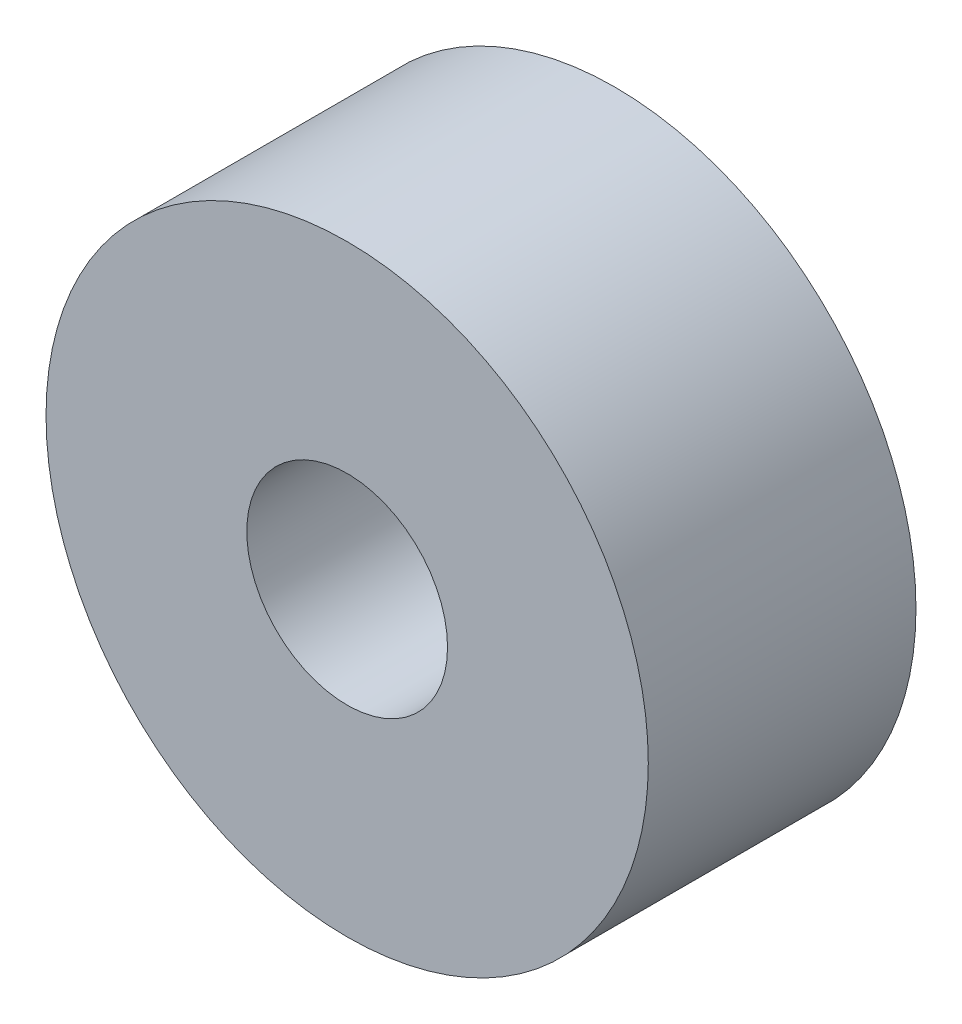
ISO-10303-21;
HEADER;
FILE_DESCRIPTION(('STEP AP214'),'2;1');
FILE_NAME('part.step','',(''),(''),'','','');
FILE_SCHEMA(('AUTOMOTIVE_DESIGN { 1 0 10303 214 1 1 1 1 }'));
ENDSEC;
DATA;
#1=APPLICATION_CONTEXT('core data for automotive mechanical design processes');
#2=APPLICATION_PROTOCOL_DEFINITION('international standard','automotive_design',2000,#1);
#3=PRODUCT_CONTEXT('',#1,'mechanical');
#4=PRODUCT('Part','Part','',(#3));
#5=PRODUCT_RELATED_PRODUCT_CATEGORY('part','',(#4));
#6=PRODUCT_DEFINITION_FORMATION('','',#4);
#7=PRODUCT_DEFINITION_CONTEXT('part definition',#1,'design');
#8=PRODUCT_DEFINITION('design','',#6,#7);
#9=PRODUCT_DEFINITION_SHAPE('','',#8);
#10=(LENGTH_UNIT() NAMED_UNIT(*) SI_UNIT(.MILLI.,.METRE.));
#11=(NAMED_UNIT(*) PLANE_ANGLE_UNIT() SI_UNIT($,.RADIAN.));
#12=(NAMED_UNIT(*) SI_UNIT($,.STERADIAN.) SOLID_ANGLE_UNIT());
#13=UNCERTAINTY_MEASURE_WITH_UNIT(LENGTH_MEASURE(1.E-05),#10,'distance_accuracy_value','');
#14=(GEOMETRIC_REPRESENTATION_CONTEXT(3) GLOBAL_UNCERTAINTY_ASSIGNED_CONTEXT((#13)) GLOBAL_UNIT_ASSIGNED_CONTEXT((#10,
#11,#12)) REPRESENTATION_CONTEXT('',''));
#15=CARTESIAN_POINT('',(0.,0.,0.));
#16=DIRECTION('',(0.,0.,1.));
#17=DIRECTION('',(1.,0.,0.));
#18=AXIS2_PLACEMENT_3D('',#15,#16,#17);
#19=CARTESIAN_POINT('',(0.,0.,4.));
#20=DIRECTION('',(0.,0.,1.));
#21=DIRECTION('',(1.,0.,0.));
#22=AXIS2_PLACEMENT_3D('',#19,#20,#21);
#23=PLANE('',#22);
#24=CARTESIAN_POINT('',(0.,0.,4.));
#25=DIRECTION('',(0.,0.,1.));
#26=DIRECTION('',(1.,0.,0.));
#27=AXIS2_PLACEMENT_3D('',#24,#25,#26);
#28=CIRCLE('',#27,4.5);
#29=CARTESIAN_POINT('',(4.5,0.,4.));
#30=VERTEX_POINT('',#29);
#31=EDGE_CURVE('E10',#30,#30,#28,.T.);
#32=ORIENTED_EDGE('',*,*,#31,.T.);
#33=EDGE_LOOP('',(#32));
#34=FACE_BOUND('',#33,.T.);
#35=CARTESIAN_POINT('',(0.,0.,4.));
#36=DIRECTION('',(0.,0.,1.));
#37=DIRECTION('',(1.,0.,0.));
#38=AXIS2_PLACEMENT_3D('',#35,#36,#37);
#39=CIRCLE('',#38,1.5);
#40=CARTESIAN_POINT('',(1.5,0.,4.));
#41=VERTEX_POINT('',#40);
#42=EDGE_CURVE('E50',#41,#41,#39,.T.);
#43=ORIENTED_EDGE('',*,*,#42,.F.);
#44=EDGE_LOOP('',(#43));
#45=FACE_BOUND('',#44,.T.);
#46=ADVANCED_FACE('F37',(#34,#45),#23,.T.);
#47=CARTESIAN_POINT('',(0.,0.,0.));
#48=DIRECTION('',(0.,0.,1.));
#49=DIRECTION('',(1.,0.,0.));
#50=AXIS2_PLACEMENT_3D('',#47,#48,#49);
#51=PLANE('',#50);
#52=CARTESIAN_POINT('',(0.,0.,0.));
#53=DIRECTION('',(0.,0.,1.));
#54=DIRECTION('',(1.,0.,0.));
#55=AXIS2_PLACEMENT_3D('',#52,#53,#54);
#56=CIRCLE('',#55,4.5);
#57=CARTESIAN_POINT('',(4.5,0.,0.));
#58=VERTEX_POINT('',#57);
#59=EDGE_CURVE('E41',#58,#58,#56,.T.);
#60=ORIENTED_EDGE('',*,*,#59,.F.);
#61=EDGE_LOOP('',(#60));
#62=FACE_BOUND('',#61,.T.);
#63=CARTESIAN_POINT('',(0.,0.,0.));
#64=DIRECTION('',(0.,0.,1.));
#65=DIRECTION('',(1.,0.,0.));
#66=AXIS2_PLACEMENT_3D('',#63,#64,#65);
#67=CIRCLE('',#66,1.5);
#68=CARTESIAN_POINT('',(1.5,0.,0.));
#69=VERTEX_POINT('',#68);
#70=EDGE_CURVE('E52',#69,#69,#67,.T.);
#71=ORIENTED_EDGE('',*,*,#70,.T.);
#72=EDGE_LOOP('',(#71));
#73=FACE_BOUND('',#72,.T.);
#74=ADVANCED_FACE('F64',(#62,#73),#51,.F.);
#75=CARTESIAN_POINT('',(0.,0.,4.));
#76=DIRECTION('',(0.,0.,-1.));
#77=DIRECTION('',(-1.,0.,0.));
#78=AXIS2_PLACEMENT_3D('',#75,#76,#77);
#79=CYLINDRICAL_SURFACE('',#78,4.5);
#80=ORIENTED_EDGE('',*,*,#31,.F.);
#81=EDGE_LOOP('',(#80));
#82=FACE_BOUND('',#81,.T.);
#83=ORIENTED_EDGE('',*,*,#59,.T.);
#84=EDGE_LOOP('',(#83));
#85=FACE_BOUND('',#84,.T.);
#86=ADVANCED_FACE('F39',(#82,#85),#79,.T.);
#87=CARTESIAN_POINT('',(0.,0.,4.));
#88=DIRECTION('',(0.,0.,-1.));
#89=DIRECTION('',(-1.,0.,0.));
#90=AXIS2_PLACEMENT_3D('',#87,#88,#89);
#91=CYLINDRICAL_SURFACE('',#90,1.5);
#92=ORIENTED_EDGE('',*,*,#42,.T.);
#93=EDGE_LOOP('',(#92));
#94=FACE_BOUND('',#93,.T.);
#95=ORIENTED_EDGE('',*,*,#70,.F.);
#96=EDGE_LOOP('',(#95));
#97=FACE_BOUND('',#96,.T.);
#98=ADVANCED_FACE('F60',(#94,#97),#91,.F.);
#99=CLOSED_SHELL('',(#46,#74,#86,#98));
#100=MANIFOLD_SOLID_BREP('B2',#99);
#101=ADVANCED_BREP_SHAPE_REPRESENTATION('',(#18,#100),#14);
#102=SHAPE_DEFINITION_REPRESENTATION(#9,#101);
ENDSEC;
END-ISO-10303-21;
